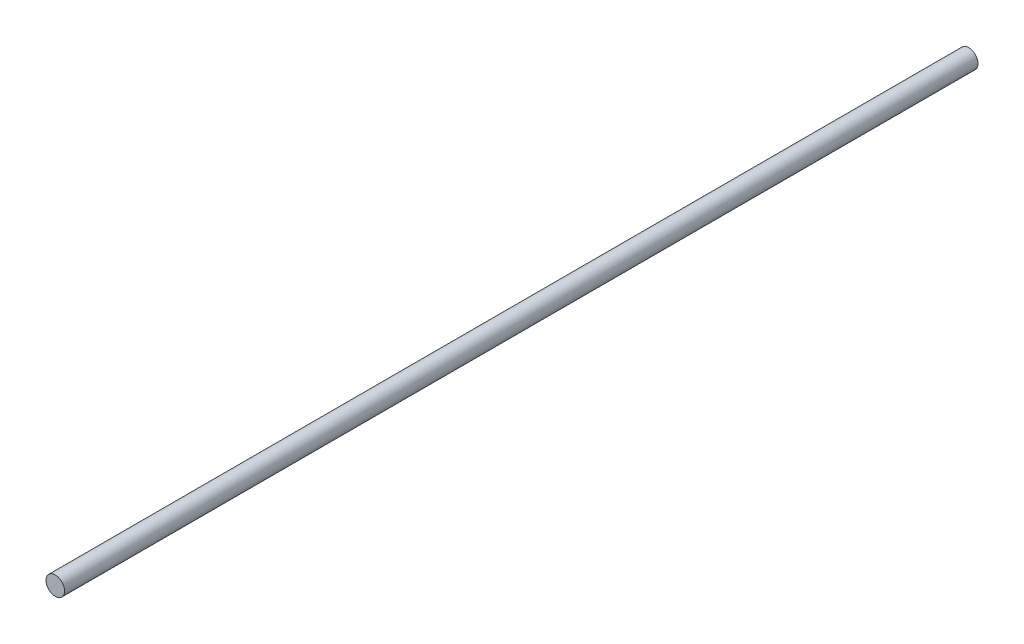
ISO-10303-21;
HEADER;
FILE_DESCRIPTION(('STEP AP214'),'2;1');
FILE_NAME('part.step','',(''),(''),'','','');
FILE_SCHEMA(('AUTOMOTIVE_DESIGN { 1 0 10303 214 1 1 1 1 }'));
ENDSEC;
DATA;
#1=APPLICATION_CONTEXT('core data for automotive mechanical design processes');
#2=APPLICATION_PROTOCOL_DEFINITION('international standard','automotive_design',2000,#1);
#3=PRODUCT_CONTEXT('',#1,'mechanical');
#4=PRODUCT('Part','Part','',(#3));
#5=PRODUCT_RELATED_PRODUCT_CATEGORY('part','',(#4));
#6=PRODUCT_DEFINITION_FORMATION('','',#4);
#7=PRODUCT_DEFINITION_CONTEXT('part definition',#1,'design');
#8=PRODUCT_DEFINITION('design','',#6,#7);
#9=PRODUCT_DEFINITION_SHAPE('','',#8);
#10=(LENGTH_UNIT() NAMED_UNIT(*) SI_UNIT(.MILLI.,.METRE.));
#11=(NAMED_UNIT(*) PLANE_ANGLE_UNIT() SI_UNIT($,.RADIAN.));
#12=(NAMED_UNIT(*) SI_UNIT($,.STERADIAN.) SOLID_ANGLE_UNIT());
#13=UNCERTAINTY_MEASURE_WITH_UNIT(LENGTH_MEASURE(1.E-05),#10,'distance_accuracy_value','');
#14=(GEOMETRIC_REPRESENTATION_CONTEXT(3) GLOBAL_UNCERTAINTY_ASSIGNED_CONTEXT((#13)) GLOBAL_UNIT_ASSIGNED_CONTEXT((#10,
#11,#12)) REPRESENTATION_CONTEXT('',''));
#15=CARTESIAN_POINT('',(0.,0.,0.));
#16=DIRECTION('',(0.,0.,1.));
#17=DIRECTION('',(1.,0.,0.));
#18=AXIS2_PLACEMENT_3D('',#15,#16,#17);
#19=CARTESIAN_POINT('',(0.,0.,295.));
#20=DIRECTION('',(0.,0.,-1.));
#21=DIRECTION('',(-1.,0.,0.));
#22=AXIS2_PLACEMENT_3D('',#19,#20,#21);
#23=CYLINDRICAL_SURFACE('',#22,3.);
#24=CARTESIAN_POINT('',(0.,0.,295.));
#25=DIRECTION('',(0.,0.,1.));
#26=DIRECTION('',(1.,0.,0.));
#27=AXIS2_PLACEMENT_3D('',#24,#25,#26);
#28=CIRCLE('',#27,3.);
#29=CARTESIAN_POINT('',(3.,0.,295.));
#30=VERTEX_POINT('',#29);
#31=EDGE_CURVE('E10',#30,#30,#28,.T.);
#32=ORIENTED_EDGE('',*,*,#31,.F.);
#33=EDGE_LOOP('',(#32));
#34=FACE_BOUND('',#33,.T.);
#35=CARTESIAN_POINT('',(0.,0.,0.));
#36=DIRECTION('',(0.,0.,1.));
#37=DIRECTION('',(1.,0.,0.));
#38=AXIS2_PLACEMENT_3D('',#35,#36,#37);
#39=CIRCLE('',#38,3.);
#40=CARTESIAN_POINT('',(3.,0.,0.));
#41=VERTEX_POINT('',#40);
#42=EDGE_CURVE('E44',#41,#41,#39,.T.);
#43=ORIENTED_EDGE('',*,*,#42,.T.);
#44=EDGE_LOOP('',(#43));
#45=FACE_BOUND('',#44,.T.);
#46=ADVANCED_FACE('F41',(#34,#45),#23,.T.);
#47=CARTESIAN_POINT('',(0.,0.,295.));
#48=DIRECTION('',(0.,0.,1.));
#49=DIRECTION('',(1.,0.,0.));
#50=AXIS2_PLACEMENT_3D('',#47,#48,#49);
#51=PLANE('',#50);
#52=ORIENTED_EDGE('',*,*,#31,.T.);
#53=EDGE_LOOP('',(#52));
#54=FACE_BOUND('',#53,.T.);
#55=ADVANCED_FACE('F58',(#54),#51,.T.);
#56=CARTESIAN_POINT('',(0.,0.,0.));
#57=DIRECTION('',(0.,0.,1.));
#58=DIRECTION('',(1.,0.,0.));
#59=AXIS2_PLACEMENT_3D('',#56,#57,#58);
#60=PLANE('',#59);
#61=ORIENTED_EDGE('',*,*,#42,.F.);
#62=EDGE_LOOP('',(#61));
#63=FACE_BOUND('',#62,.T.);
#64=ADVANCED_FACE('F56',(#63),#60,.F.);
#65=CLOSED_SHELL('',(#46,#55,#64));
#66=MANIFOLD_SOLID_BREP('B2',#65);
#67=ADVANCED_BREP_SHAPE_REPRESENTATION('',(#18,#66),#14);
#68=SHAPE_DEFINITION_REPRESENTATION(#9,#67);
ENDSEC;
END-ISO-10303-21;
